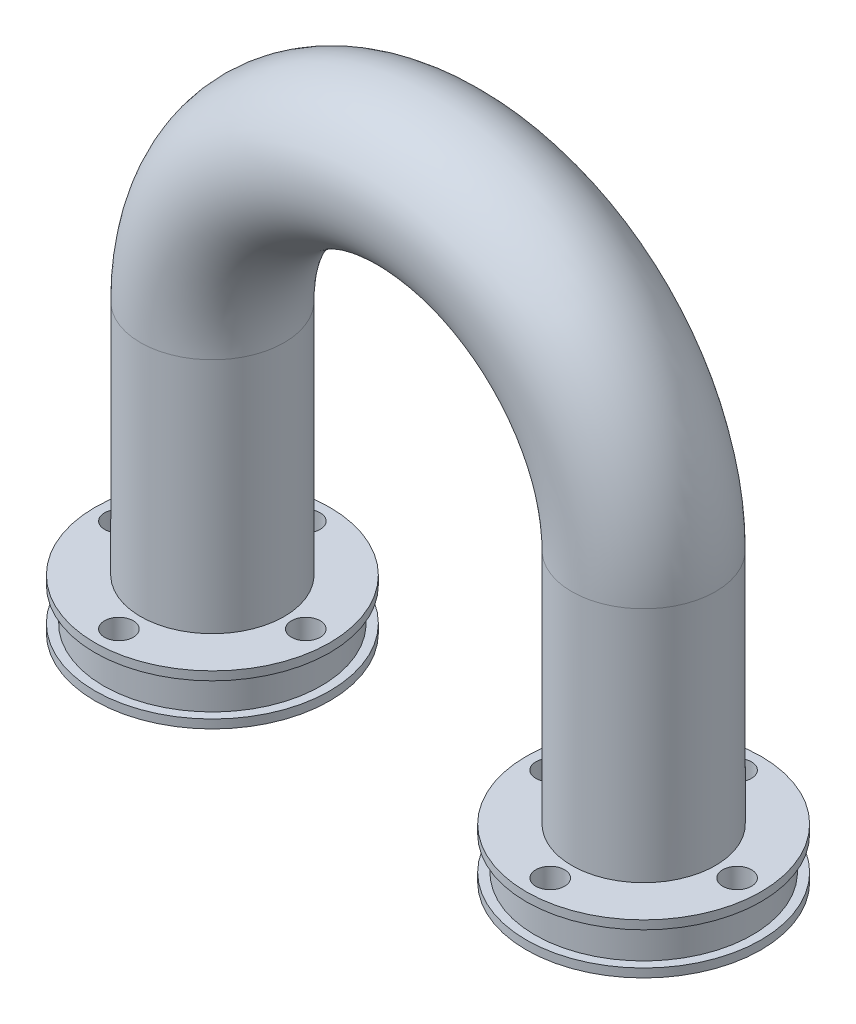
ISO-10303-21;
HEADER;
FILE_DESCRIPTION(('STEP AP214'),'2;1');
FILE_NAME('part.step','',(''),(''),'','','');
FILE_SCHEMA(('AUTOMOTIVE_DESIGN { 1 0 10303 214 1 1 1 1 }'));
ENDSEC;
DATA;
#1=APPLICATION_CONTEXT('core data for automotive mechanical design processes');
#2=APPLICATION_PROTOCOL_DEFINITION('international standard','automotive_design',2000,#1);
#3=PRODUCT_CONTEXT('',#1,'mechanical');
#4=PRODUCT('Part','Part','',(#3));
#5=PRODUCT_RELATED_PRODUCT_CATEGORY('part','',(#4));
#6=PRODUCT_DEFINITION_FORMATION('','',#4);
#7=PRODUCT_DEFINITION_CONTEXT('part definition',#1,'design');
#8=PRODUCT_DEFINITION('design','',#6,#7);
#9=PRODUCT_DEFINITION_SHAPE('','',#8);
#10=(LENGTH_UNIT() NAMED_UNIT(*) SI_UNIT(.MILLI.,.METRE.));
#11=(NAMED_UNIT(*) PLANE_ANGLE_UNIT() SI_UNIT($,.RADIAN.));
#12=(NAMED_UNIT(*) SI_UNIT($,.STERADIAN.) SOLID_ANGLE_UNIT());
#13=UNCERTAINTY_MEASURE_WITH_UNIT(LENGTH_MEASURE(1.E-05),#10,'distance_accuracy_value','');
#14=(GEOMETRIC_REPRESENTATION_CONTEXT(3) GLOBAL_UNCERTAINTY_ASSIGNED_CONTEXT((#13)) GLOBAL_UNIT_ASSIGNED_CONTEXT((#10,
#11,#12)) REPRESENTATION_CONTEXT('',''));
#15=CARTESIAN_POINT('',(0.,0.,0.));
#16=DIRECTION('',(0.,0.,1.));
#17=DIRECTION('',(1.,0.,0.));
#18=AXIS2_PLACEMENT_3D('',#15,#16,#17);
#19=CARTESIAN_POINT('',(30.,-33.,0.));
#20=DIRECTION('',(0.,1.,0.));
#21=DIRECTION('',(-1.,0.,0.));
#22=AXIS2_PLACEMENT_3D('',#19,#20,#21);
#23=CYLINDRICAL_SURFACE('',#22,10.);
#24=CARTESIAN_POINT('',(30.,0.,0.));
#25=DIRECTION('',(0.,1.,0.));
#26=DIRECTION('',(-1.,0.,0.));
#27=AXIS2_PLACEMENT_3D('',#24,#25,#26);
#28=CIRCLE('',#27,10.);
#29=CARTESIAN_POINT('',(40.,0.,0.));
#30=VERTEX_POINT('',#29);
#31=EDGE_CURVE('E52',#30,#30,#28,.T.);
#32=ORIENTED_EDGE('',*,*,#31,.F.);
#33=EDGE_LOOP('',(#32));
#34=FACE_BOUND('',#33,.T.);
#35=CARTESIAN_POINT('',(30.,-33.,0.));
#36=DIRECTION('',(0.,1.,0.));
#37=DIRECTION('',(-1.,0.,0.));
#38=AXIS2_PLACEMENT_3D('',#35,#36,#37);
#39=CIRCLE('',#38,10.);
#40=CARTESIAN_POINT('',(20.,-33.,0.));
#41=VERTEX_POINT('',#40);
#42=EDGE_CURVE('E61',#41,#41,#39,.T.);
#43=ORIENTED_EDGE('',*,*,#42,.T.);
#44=EDGE_LOOP('',(#43));
#45=FACE_BOUND('',#44,.T.);
#46=ADVANCED_FACE('F37',(#34,#45),#23,.T.);
#47=CARTESIAN_POINT('',(0.,0.,0.));
#48=DIRECTION('',(0.,0.,1.));
#49=DIRECTION('',(1.,0.,0.));
#50=AXIS2_PLACEMENT_3D('',#47,#48,#49);
#51=TOROIDAL_SURFACE('',#50,30.,10.);
#52=CARTESIAN_POINT('',(-30.,0.,0.));
#53=DIRECTION('',(0.,-1.,0.));
#54=DIRECTION('',(1.,0.,0.));
#55=AXIS2_PLACEMENT_3D('',#52,#53,#54);
#56=CIRCLE('',#55,10.);
#57=CARTESIAN_POINT('',(-40.,0.,0.));
#58=VERTEX_POINT('',#57);
#59=EDGE_CURVE('E46',#58,#58,#56,.T.);
#60=CARTESIAN_POINT('',(0.,0.,0.));
#61=DIRECTION('',(0.,0.,1.));
#62=DIRECTION('',(1.,0.,0.));
#63=AXIS2_PLACEMENT_3D('',#60,#61,#62);
#64=CIRCLE('',#63,40.);
#65=EDGE_CURVE('',#30,#58,#64,.T.);
#66=ORIENTED_EDGE('',*,*,#31,.T.);
#67=ORIENTED_EDGE('',*,*,#59,.F.);
#68=ORIENTED_EDGE('',*,*,#65,.T.);
#69=ORIENTED_EDGE('',*,*,#65,.F.);
#70=EDGE_LOOP('',(#66,#68,#67,#69));
#71=FACE_BOUND('',#70,.T.);
#72=ADVANCED_FACE('F188',(#71),#51,.T.);
#73=CARTESIAN_POINT('',(-30.,0.,0.));
#74=DIRECTION('',(0.,-1.,0.));
#75=DIRECTION('',(1.,0.,0.));
#76=AXIS2_PLACEMENT_3D('',#73,#74,#75);
#77=CYLINDRICAL_SURFACE('',#76,10.);
#78=CARTESIAN_POINT('',(-30.,-33.,0.));
#79=DIRECTION('',(0.,-1.,0.));
#80=DIRECTION('',(1.,0.,0.));
#81=AXIS2_PLACEMENT_3D('',#78,#79,#80);
#82=CIRCLE('',#81,10.);
#83=CARTESIAN_POINT('',(-20.,-33.,0.));
#84=VERTEX_POINT('',#83);
#85=EDGE_CURVE('E10',#84,#84,#82,.T.);
#86=ORIENTED_EDGE('',*,*,#85,.F.);
#87=EDGE_LOOP('',(#86));
#88=FACE_BOUND('',#87,.T.);
#89=ORIENTED_EDGE('',*,*,#59,.T.);
#90=EDGE_LOOP('',(#89));
#91=FACE_BOUND('',#90,.T.);
#92=ADVANCED_FACE('F39',(#88,#91),#77,.T.);
#93=CARTESIAN_POINT('',(30.,-33.,0.));
#94=DIRECTION('',(0.,1.,0.));
#95=DIRECTION('',(-1.,0.,0.));
#96=AXIS2_PLACEMENT_3D('',#93,#94,#95);
#97=CYLINDRICAL_SURFACE('',#96,6.);
#98=CARTESIAN_POINT('',(30.,0.,0.));
#99=DIRECTION('',(0.,-1.,0.));
#100=DIRECTION('',(1.,0.,0.));
#101=AXIS2_PLACEMENT_3D('',#98,#99,#100);
#102=CIRCLE('',#101,6.);
#103=CARTESIAN_POINT('',(36.,0.,0.));
#104=VERTEX_POINT('',#103);
#105=EDGE_CURVE('E174',#104,#104,#102,.F.);
#106=ORIENTED_EDGE('',*,*,#105,.T.);
#107=EDGE_LOOP('',(#106));
#108=FACE_BOUND('',#107,.T.);
#109=CARTESIAN_POINT('',(30.,-40.,0.));
#110=DIRECTION('',(0.,1.,0.));
#111=DIRECTION('',(0.,0.,-1.));
#112=AXIS2_PLACEMENT_3D('',#109,#110,#111);
#113=CIRCLE('',#112,6.);
#114=CARTESIAN_POINT('',(30.,-40.,-6.));
#115=VERTEX_POINT('',#114);
#116=EDGE_CURVE('E130',#115,#115,#113,.T.);
#117=ORIENTED_EDGE('',*,*,#116,.F.);
#118=EDGE_LOOP('',(#117));
#119=FACE_BOUND('',#118,.T.);
#120=ADVANCED_FACE('F222',(#108,#119),#97,.F.);
#121=CARTESIAN_POINT('',(0.,0.,0.));
#122=DIRECTION('',(0.,0.,1.));
#123=DIRECTION('',(1.,0.,0.));
#124=AXIS2_PLACEMENT_3D('',#121,#122,#123);
#125=TOROIDAL_SURFACE('',#124,30.,6.);
#126=CARTESIAN_POINT('',(-30.,0.,0.));
#127=DIRECTION('',(0.,-1.,0.));
#128=DIRECTION('',(1.,0.,0.));
#129=AXIS2_PLACEMENT_3D('',#126,#127,#128);
#130=CIRCLE('',#129,6.);
#131=CARTESIAN_POINT('',(-36.,0.,0.));
#132=VERTEX_POINT('',#131);
#133=EDGE_CURVE('E178',#132,#132,#130,.T.);
#134=CARTESIAN_POINT('',(0.,0.,0.));
#135=DIRECTION('',(0.,0.,1.));
#136=DIRECTION('',(1.,0.,0.));
#137=AXIS2_PLACEMENT_3D('',#134,#135,#136);
#138=CIRCLE('',#137,36.);
#139=EDGE_CURVE('',#104,#132,#138,.T.);
#140=ORIENTED_EDGE('',*,*,#105,.F.);
#141=ORIENTED_EDGE('',*,*,#133,.T.);
#142=ORIENTED_EDGE('',*,*,#139,.T.);
#143=ORIENTED_EDGE('',*,*,#139,.F.);
#144=EDGE_LOOP('',(#140,#142,#141,#143));
#145=FACE_BOUND('',#144,.T.);
#146=ADVANCED_FACE('F228',(#145),#125,.F.);
#147=CARTESIAN_POINT('',(-30.,0.,0.));
#148=DIRECTION('',(0.,-1.,0.));
#149=DIRECTION('',(1.,0.,0.));
#150=AXIS2_PLACEMENT_3D('',#147,#148,#149);
#151=CYLINDRICAL_SURFACE('',#150,6.);
#152=ORIENTED_EDGE('',*,*,#133,.F.);
#153=EDGE_LOOP('',(#152));
#154=FACE_BOUND('',#153,.T.);
#155=CARTESIAN_POINT('',(-30.,-40.,0.));
#156=DIRECTION('',(0.,-1.,0.));
#157=DIRECTION('',(0.,0.,-1.));
#158=AXIS2_PLACEMENT_3D('',#155,#156,#157);
#159=CIRCLE('',#158,6.);
#160=CARTESIAN_POINT('',(-30.,-40.,-6.));
#161=VERTEX_POINT('',#160);
#162=EDGE_CURVE('E170',#161,#161,#159,.T.);
#163=ORIENTED_EDGE('',*,*,#162,.T.);
#164=EDGE_LOOP('',(#163));
#165=FACE_BOUND('',#164,.T.);
#166=ADVANCED_FACE('F193',(#154,#165),#151,.F.);
#167=CARTESIAN_POINT('',(-46.3305839680992,-33.,0.));
#168=DIRECTION('',(0.,-1.,0.));
#169=DIRECTION('',(0.,0.,-1.));
#170=AXIS2_PLACEMENT_3D('',#167,#168,#169);
#171=PLANE('',#170);
#172=CARTESIAN_POINT('',(-30.,-33.,13.));
#173=DIRECTION('',(0.,-1.,0.));
#174=DIRECTION('',(0.,0.,-1.));
#175=AXIS2_PLACEMENT_3D('',#172,#173,#174);
#176=CIRCLE('',#175,2.);
#177=CARTESIAN_POINT('',(-30.,-33.,11.));
#178=VERTEX_POINT('',#177);
#179=EDGE_CURVE('E76',#178,#178,#176,.T.);
#180=ORIENTED_EDGE('',*,*,#179,.T.);
#181=EDGE_LOOP('',(#180));
#182=FACE_BOUND('',#181,.T.);
#183=CARTESIAN_POINT('',(-17.,-33.,0.));
#184=DIRECTION('',(0.,-1.,0.));
#185=DIRECTION('',(0.,0.,-1.));
#186=AXIS2_PLACEMENT_3D('',#183,#184,#185);
#187=CIRCLE('',#186,2.);
#188=CARTESIAN_POINT('',(-17.,-33.,-2.00000000000006));
#189=VERTEX_POINT('',#188);
#190=EDGE_CURVE('E71',#189,#189,#187,.T.);
#191=ORIENTED_EDGE('',*,*,#190,.T.);
#192=EDGE_LOOP('',(#191));
#193=FACE_BOUND('',#192,.T.);
#194=CARTESIAN_POINT('',(-30.0000000000001,-33.,-13.));
#195=DIRECTION('',(0.,-1.,0.));
#196=DIRECTION('',(0.,0.,-1.));
#197=AXIS2_PLACEMENT_3D('',#194,#195,#196);
#198=CIRCLE('',#197,2.);
#199=CARTESIAN_POINT('',(-30.0000000000001,-33.,-15.));
#200=VERTEX_POINT('',#199);
#201=EDGE_CURVE('E66',#200,#200,#198,.T.);
#202=ORIENTED_EDGE('',*,*,#201,.T.);
#203=EDGE_LOOP('',(#202));
#204=FACE_BOUND('',#203,.T.);
#205=CARTESIAN_POINT('',(-43.,-33.,1.50045560022697E-13));
#206=DIRECTION('',(0.,-1.,0.));
#207=DIRECTION('',(0.,0.,-1.));
#208=AXIS2_PLACEMENT_3D('',#205,#206,#207);
#209=CIRCLE('',#208,2.);
#210=CARTESIAN_POINT('',(-43.,-33.,-1.99999999999985));
#211=VERTEX_POINT('',#210);
#212=EDGE_CURVE('E60',#211,#211,#209,.T.);
#213=ORIENTED_EDGE('',*,*,#212,.T.);
#214=EDGE_LOOP('',(#213));
#215=FACE_BOUND('',#214,.T.);
#216=ORIENTED_EDGE('',*,*,#85,.T.);
#217=EDGE_LOOP('',(#216));
#218=FACE_BOUND('',#217,.T.);
#219=CARTESIAN_POINT('',(-30.,-33.,0.));
#220=DIRECTION('',(0.,-1.,0.));
#221=DIRECTION('',(0.,0.,-1.));
#222=AXIS2_PLACEMENT_3D('',#219,#220,#221);
#223=CIRCLE('',#222,16.3305839680993);
#224=CARTESIAN_POINT('',(-30.,-33.,-16.3305839680993));
#225=VERTEX_POINT('',#224);
#226=EDGE_CURVE('E146',#225,#225,#223,.T.);
#227=ORIENTED_EDGE('',*,*,#226,.F.);
#228=EDGE_LOOP('',(#227));
#229=FACE_BOUND('',#228,.T.);
#230=ADVANCED_FACE('F231',(#182,#193,#204,#215,#218,#229),#171,.F.);
#231=CARTESIAN_POINT('',(-36.,-40.,0.));
#232=DIRECTION('',(0.,1.,0.));
#233=DIRECTION('',(0.,0.,1.));
#234=AXIS2_PLACEMENT_3D('',#231,#232,#233);
#235=PLANE('',#234);
#236=CARTESIAN_POINT('',(-30.,-40.,13.));
#237=DIRECTION('',(0.,1.,0.));
#238=DIRECTION('',(0.,0.,1.));
#239=AXIS2_PLACEMENT_3D('',#236,#237,#238);
#240=CIRCLE('',#239,2.);
#241=CARTESIAN_POINT('',(-30.,-40.,15.));
#242=VERTEX_POINT('',#241);
#243=EDGE_CURVE('E72',#242,#242,#240,.T.);
#244=ORIENTED_EDGE('',*,*,#243,.T.);
#245=EDGE_LOOP('',(#244));
#246=FACE_BOUND('',#245,.T.);
#247=CARTESIAN_POINT('',(-17.,-40.,0.));
#248=DIRECTION('',(0.,1.,0.));
#249=DIRECTION('',(0.,0.,1.));
#250=AXIS2_PLACEMENT_3D('',#247,#248,#249);
#251=CIRCLE('',#250,2.);
#252=CARTESIAN_POINT('',(-17.,-40.,1.99999999999994));
#253=VERTEX_POINT('',#252);
#254=EDGE_CURVE('E67',#253,#253,#251,.T.);
#255=ORIENTED_EDGE('',*,*,#254,.T.);
#256=EDGE_LOOP('',(#255));
#257=FACE_BOUND('',#256,.T.);
#258=CARTESIAN_POINT('',(-30.0000000000001,-40.,-13.));
#259=DIRECTION('',(0.,1.,0.));
#260=DIRECTION('',(0.,0.,1.));
#261=AXIS2_PLACEMENT_3D('',#258,#259,#260);
#262=CIRCLE('',#261,2.);
#263=CARTESIAN_POINT('',(-30.0000000000001,-40.,-11.));
#264=VERTEX_POINT('',#263);
#265=EDGE_CURVE('E62',#264,#264,#262,.T.);
#266=ORIENTED_EDGE('',*,*,#265,.T.);
#267=EDGE_LOOP('',(#266));
#268=FACE_BOUND('',#267,.T.);
#269=CARTESIAN_POINT('',(-43.,-40.,1.50045560022697E-13));
#270=DIRECTION('',(0.,1.,0.));
#271=DIRECTION('',(0.,0.,1.));
#272=AXIS2_PLACEMENT_3D('',#269,#270,#271);
#273=CIRCLE('',#272,2.);
#274=CARTESIAN_POINT('',(-43.,-40.,2.00000000000015));
#275=VERTEX_POINT('',#274);
#276=EDGE_CURVE('E56',#275,#275,#273,.T.);
#277=ORIENTED_EDGE('',*,*,#276,.T.);
#278=EDGE_LOOP('',(#277));
#279=FACE_BOUND('',#278,.T.);
#280=ORIENTED_EDGE('',*,*,#162,.F.);
#281=EDGE_LOOP('',(#280));
#282=FACE_BOUND('',#281,.T.);
#283=CARTESIAN_POINT('',(-30.,-40.,0.));
#284=DIRECTION('',(0.,-1.,0.));
#285=DIRECTION('',(0.,0.,-1.));
#286=AXIS2_PLACEMENT_3D('',#283,#284,#285);
#287=CIRCLE('',#286,16.3305839680993);
#288=CARTESIAN_POINT('',(-30.,-40.,-16.3305839680993));
#289=VERTEX_POINT('',#288);
#290=EDGE_CURVE('E166',#289,#289,#287,.T.);
#291=ORIENTED_EDGE('',*,*,#290,.T.);
#292=EDGE_LOOP('',(#291));
#293=FACE_BOUND('',#292,.T.);
#294=ADVANCED_FACE('F246',(#246,#257,#268,#279,#282,#293),#235,.F.);
#295=CARTESIAN_POINT('',(-30.,-33.,0.));
#296=DIRECTION('',(0.,-1.,0.));
#297=DIRECTION('',(0.,0.,-1.));
#298=AXIS2_PLACEMENT_3D('',#295,#296,#297);
#299=CYLINDRICAL_SURFACE('',#298,16.3305839680993);
#300=ORIENTED_EDGE('',*,*,#290,.F.);
#301=EDGE_LOOP('',(#300));
#302=FACE_BOUND('',#301,.T.);
#303=CARTESIAN_POINT('',(-30.,-38.8,0.));
#304=DIRECTION('',(0.,-1.,0.));
#305=DIRECTION('',(0.,0.,-1.));
#306=AXIS2_PLACEMENT_3D('',#303,#304,#305);
#307=CIRCLE('',#306,16.3305839680993);
#308=CARTESIAN_POINT('',(-30.,-38.8,-16.3305839680993));
#309=VERTEX_POINT('',#308);
#310=EDGE_CURVE('E162',#309,#309,#307,.T.);
#311=ORIENTED_EDGE('',*,*,#310,.T.);
#312=EDGE_LOOP('',(#311));
#313=FACE_BOUND('',#312,.T.);
#314=ADVANCED_FACE('F250',(#302,#313),#299,.T.);
#315=CARTESIAN_POINT('',(-46.3305839680992,-38.8,0.));
#316=DIRECTION('',(0.,-1.,0.));
#317=DIRECTION('',(0.,0.,-1.));
#318=AXIS2_PLACEMENT_3D('',#315,#316,#317);
#319=PLANE('',#318);
#320=ORIENTED_EDGE('',*,*,#310,.F.);
#321=EDGE_LOOP('',(#320));
#322=FACE_BOUND('',#321,.T.);
#323=CARTESIAN_POINT('',(-30.,-38.8,0.));
#324=DIRECTION('',(0.,-1.,0.));
#325=DIRECTION('',(0.,0.,-1.));
#326=AXIS2_PLACEMENT_3D('',#323,#324,#325);
#327=CIRCLE('',#326,15.1305839680993);
#328=CARTESIAN_POINT('',(-30.,-38.8,-15.1305839680993));
#329=VERTEX_POINT('',#328);
#330=EDGE_CURVE('E158',#329,#329,#327,.T.);
#331=ORIENTED_EDGE('',*,*,#330,.T.);
#332=EDGE_LOOP('',(#331));
#333=FACE_BOUND('',#332,.T.);
#334=ADVANCED_FACE('F254',(#322,#333),#319,.F.);
#335=CARTESIAN_POINT('',(-30.,-33.,0.));
#336=DIRECTION('',(0.,-1.,0.));
#337=DIRECTION('',(0.,0.,-1.));
#338=AXIS2_PLACEMENT_3D('',#335,#336,#337);
#339=CYLINDRICAL_SURFACE('',#338,15.1305839680993);
#340=ORIENTED_EDGE('',*,*,#330,.F.);
#341=EDGE_LOOP('',(#340));
#342=FACE_BOUND('',#341,.T.);
#343=CARTESIAN_POINT('',(-30.,-34.2,0.));
#344=DIRECTION('',(0.,-1.,0.));
#345=DIRECTION('',(0.,0.,-1.));
#346=AXIS2_PLACEMENT_3D('',#343,#344,#345);
#347=CIRCLE('',#346,15.1305839680993);
#348=CARTESIAN_POINT('',(-30.,-34.2,-15.1305839680993));
#349=VERTEX_POINT('',#348);
#350=EDGE_CURVE('E154',#349,#349,#347,.T.);
#351=ORIENTED_EDGE('',*,*,#350,.T.);
#352=EDGE_LOOP('',(#351));
#353=FACE_BOUND('',#352,.T.);
#354=ADVANCED_FACE('F258',(#342,#353),#339,.T.);
#355=CARTESIAN_POINT('',(-45.1305839680993,-34.2,0.));
#356=DIRECTION('',(0.,1.,0.));
#357=DIRECTION('',(0.,0.,1.));
#358=AXIS2_PLACEMENT_3D('',#355,#356,#357);
#359=PLANE('',#358);
#360=ORIENTED_EDGE('',*,*,#350,.F.);
#361=EDGE_LOOP('',(#360));
#362=FACE_BOUND('',#361,.T.);
#363=CARTESIAN_POINT('',(-30.,-34.2,0.));
#364=DIRECTION('',(0.,-1.,0.));
#365=DIRECTION('',(0.,0.,-1.));
#366=AXIS2_PLACEMENT_3D('',#363,#364,#365);
#367=CIRCLE('',#366,16.3305839680993);
#368=CARTESIAN_POINT('',(-30.,-34.2,-16.3305839680993));
#369=VERTEX_POINT('',#368);
#370=EDGE_CURVE('E150',#369,#369,#367,.T.);
#371=ORIENTED_EDGE('',*,*,#370,.T.);
#372=EDGE_LOOP('',(#371));
#373=FACE_BOUND('',#372,.T.);
#374=ADVANCED_FACE('F262',(#362,#373),#359,.F.);
#375=CARTESIAN_POINT('',(-30.,-33.,0.));
#376=DIRECTION('',(0.,-1.,0.));
#377=DIRECTION('',(0.,0.,-1.));
#378=AXIS2_PLACEMENT_3D('',#375,#376,#377);
#379=CYLINDRICAL_SURFACE('',#378,16.3305839680993);
#380=ORIENTED_EDGE('',*,*,#370,.F.);
#381=EDGE_LOOP('',(#380));
#382=FACE_BOUND('',#381,.T.);
#383=ORIENTED_EDGE('',*,*,#226,.T.);
#384=EDGE_LOOP('',(#383));
#385=FACE_BOUND('',#384,.T.);
#386=ADVANCED_FACE('F266',(#382,#385),#379,.T.);
#387=CARTESIAN_POINT('',(-43.,-23.,1.50045560022697E-13));
#388=DIRECTION('',(0.,-1.,0.));
#389=DIRECTION('',(1.,0.,0.));
#390=AXIS2_PLACEMENT_3D('',#387,#388,#389);
#391=CYLINDRICAL_SURFACE('',#390,2.);
#392=ORIENTED_EDGE('',*,*,#276,.F.);
#393=EDGE_LOOP('',(#392));
#394=FACE_BOUND('',#393,.T.);
#395=ORIENTED_EDGE('',*,*,#212,.F.);
#396=EDGE_LOOP('',(#395));
#397=FACE_BOUND('',#396,.T.);
#398=ADVANCED_FACE('F270',(#394,#397),#391,.F.);
#399=CARTESIAN_POINT('',(-30.0000000000001,-23.,-13.));
#400=DIRECTION('',(0.,-1.,0.));
#401=DIRECTION('',(1.,0.,0.));
#402=AXIS2_PLACEMENT_3D('',#399,#400,#401);
#403=CYLINDRICAL_SURFACE('',#402,2.);
#404=ORIENTED_EDGE('',*,*,#265,.F.);
#405=EDGE_LOOP('',(#404));
#406=FACE_BOUND('',#405,.T.);
#407=ORIENTED_EDGE('',*,*,#201,.F.);
#408=EDGE_LOOP('',(#407));
#409=FACE_BOUND('',#408,.T.);
#410=ADVANCED_FACE('F274',(#406,#409),#403,.F.);
#411=CARTESIAN_POINT('',(-17.,-23.,0.));
#412=DIRECTION('',(0.,-1.,0.));
#413=DIRECTION('',(1.,0.,0.));
#414=AXIS2_PLACEMENT_3D('',#411,#412,#413);
#415=CYLINDRICAL_SURFACE('',#414,2.);
#416=ORIENTED_EDGE('',*,*,#254,.F.);
#417=EDGE_LOOP('',(#416));
#418=FACE_BOUND('',#417,.T.);
#419=ORIENTED_EDGE('',*,*,#190,.F.);
#420=EDGE_LOOP('',(#419));
#421=FACE_BOUND('',#420,.T.);
#422=ADVANCED_FACE('F278',(#418,#421),#415,.F.);
#423=CARTESIAN_POINT('',(-30.,-23.,13.));
#424=DIRECTION('',(0.,-1.,0.));
#425=DIRECTION('',(1.,0.,0.));
#426=AXIS2_PLACEMENT_3D('',#423,#424,#425);
#427=CYLINDRICAL_SURFACE('',#426,2.);
#428=ORIENTED_EDGE('',*,*,#243,.F.);
#429=EDGE_LOOP('',(#428));
#430=FACE_BOUND('',#429,.T.);
#431=ORIENTED_EDGE('',*,*,#179,.F.);
#432=EDGE_LOOP('',(#431));
#433=FACE_BOUND('',#432,.T.);
#434=ADVANCED_FACE('F200',(#430,#433),#427,.F.);
#435=CARTESIAN_POINT('',(46.3305839680992,-33.,0.));
#436=DIRECTION('',(0.,-1.,0.));
#437=DIRECTION('',(0.,0.,-1.));
#438=AXIS2_PLACEMENT_3D('',#435,#436,#437);
#439=PLANE('',#438);
#440=CARTESIAN_POINT('',(30.,-33.,13.));
#441=DIRECTION('',(0.,-1.,0.));
#442=DIRECTION('',(0.,0.,-1.));
#443=AXIS2_PLACEMENT_3D('',#440,#441,#442);
#444=CIRCLE('',#443,2.);
#445=CARTESIAN_POINT('',(30.,-33.,11.));
#446=VERTEX_POINT('',#445);
#447=EDGE_CURVE('E102',#446,#446,#444,.F.);
#448=ORIENTED_EDGE('',*,*,#447,.F.);
#449=EDGE_LOOP('',(#448));
#450=FACE_BOUND('',#449,.T.);
#451=CARTESIAN_POINT('',(17.,-33.,0.));
#452=DIRECTION('',(0.,-1.,0.));
#453=DIRECTION('',(0.,0.,-1.));
#454=AXIS2_PLACEMENT_3D('',#451,#452,#453);
#455=CIRCLE('',#454,2.);
#456=CARTESIAN_POINT('',(17.,-33.,-2.00000000000006));
#457=VERTEX_POINT('',#456);
#458=EDGE_CURVE('E89',#457,#457,#455,.F.);
#459=ORIENTED_EDGE('',*,*,#458,.F.);
#460=EDGE_LOOP('',(#459));
#461=FACE_BOUND('',#460,.T.);
#462=CARTESIAN_POINT('',(30.0000000000001,-33.,-13.));
#463=DIRECTION('',(0.,-1.,0.));
#464=DIRECTION('',(0.,0.,-1.));
#465=AXIS2_PLACEMENT_3D('',#462,#463,#464);
#466=CIRCLE('',#465,2.);
#467=CARTESIAN_POINT('',(30.0000000000001,-33.,-15.));
#468=VERTEX_POINT('',#467);
#469=EDGE_CURVE('E85',#468,#468,#466,.F.);
#470=ORIENTED_EDGE('',*,*,#469,.F.);
#471=EDGE_LOOP('',(#470));
#472=FACE_BOUND('',#471,.T.);
#473=CARTESIAN_POINT('',(43.,-33.,1.50045560022697E-13));
#474=DIRECTION('',(0.,-1.,0.));
#475=DIRECTION('',(0.,0.,-1.));
#476=AXIS2_PLACEMENT_3D('',#473,#474,#475);
#477=CIRCLE('',#476,2.);
#478=CARTESIAN_POINT('',(43.,-33.,-1.99999999999985));
#479=VERTEX_POINT('',#478);
#480=EDGE_CURVE('E81',#479,#479,#477,.F.);
#481=ORIENTED_EDGE('',*,*,#480,.F.);
#482=EDGE_LOOP('',(#481));
#483=FACE_BOUND('',#482,.T.);
#484=ORIENTED_EDGE('',*,*,#42,.F.);
#485=EDGE_LOOP('',(#484));
#486=FACE_BOUND('',#485,.T.);
#487=CARTESIAN_POINT('',(30.,-33.,0.));
#488=DIRECTION('',(0.,1.,0.));
#489=DIRECTION('',(0.,0.,-1.));
#490=AXIS2_PLACEMENT_3D('',#487,#488,#489);
#491=CIRCLE('',#490,16.3305839680993);
#492=CARTESIAN_POINT('',(30.,-33.,-16.3305839680993));
#493=VERTEX_POINT('',#492);
#494=EDGE_CURVE('E106',#493,#493,#491,.T.);
#495=ORIENTED_EDGE('',*,*,#494,.T.);
#496=EDGE_LOOP('',(#495));
#497=FACE_BOUND('',#496,.T.);
#498=ADVANCED_FACE('F196',(#450,#461,#472,#483,#486,#497),#439,.F.);
#499=CARTESIAN_POINT('',(36.,-40.,0.));
#500=DIRECTION('',(0.,1.,0.));
#501=DIRECTION('',(0.,0.,1.));
#502=AXIS2_PLACEMENT_3D('',#499,#500,#501);
#503=PLANE('',#502);
#504=CARTESIAN_POINT('',(30.,-40.,13.));
#505=DIRECTION('',(0.,1.,0.));
#506=DIRECTION('',(0.,0.,1.));
#507=AXIS2_PLACEMENT_3D('',#504,#505,#506);
#508=CIRCLE('',#507,2.);
#509=CARTESIAN_POINT('',(30.,-40.,15.));
#510=VERTEX_POINT('',#509);
#511=EDGE_CURVE('E41',#510,#510,#508,.F.);
#512=ORIENTED_EDGE('',*,*,#511,.F.);
#513=EDGE_LOOP('',(#512));
#514=FACE_BOUND('',#513,.T.);
#515=CARTESIAN_POINT('',(17.,-40.,0.));
#516=DIRECTION('',(0.,1.,0.));
#517=DIRECTION('',(0.,0.,1.));
#518=AXIS2_PLACEMENT_3D('',#515,#516,#517);
#519=CIRCLE('',#518,2.);
#520=CARTESIAN_POINT('',(17.,-40.,1.99999999999994));
#521=VERTEX_POINT('',#520);
#522=EDGE_CURVE('E86',#521,#521,#519,.F.);
#523=ORIENTED_EDGE('',*,*,#522,.F.);
#524=EDGE_LOOP('',(#523));
#525=FACE_BOUND('',#524,.T.);
#526=CARTESIAN_POINT('',(30.0000000000001,-40.,-13.));
#527=DIRECTION('',(0.,1.,0.));
#528=DIRECTION('',(0.,0.,1.));
#529=AXIS2_PLACEMENT_3D('',#526,#527,#528);
#530=CIRCLE('',#529,2.);
#531=CARTESIAN_POINT('',(30.0000000000001,-40.,-11.));
#532=VERTEX_POINT('',#531);
#533=EDGE_CURVE('E82',#532,#532,#530,.F.);
#534=ORIENTED_EDGE('',*,*,#533,.F.);
#535=EDGE_LOOP('',(#534));
#536=FACE_BOUND('',#535,.T.);
#537=CARTESIAN_POINT('',(43.,-40.,1.50045560022697E-13));
#538=DIRECTION('',(0.,1.,0.));
#539=DIRECTION('',(0.,0.,1.));
#540=AXIS2_PLACEMENT_3D('',#537,#538,#539);
#541=CIRCLE('',#540,2.);
#542=CARTESIAN_POINT('',(43.,-40.,2.00000000000015));
#543=VERTEX_POINT('',#542);
#544=EDGE_CURVE('E77',#543,#543,#541,.F.);
#545=ORIENTED_EDGE('',*,*,#544,.F.);
#546=EDGE_LOOP('',(#545));
#547=FACE_BOUND('',#546,.T.);
#548=ORIENTED_EDGE('',*,*,#116,.T.);
#549=EDGE_LOOP('',(#548));
#550=FACE_BOUND('',#549,.T.);
#551=CARTESIAN_POINT('',(30.,-40.,0.));
#552=DIRECTION('',(0.,1.,0.));
#553=DIRECTION('',(0.,0.,-1.));
#554=AXIS2_PLACEMENT_3D('',#551,#552,#553);
#555=CIRCLE('',#554,16.3305839680993);
#556=CARTESIAN_POINT('',(30.,-40.,-16.3305839680993));
#557=VERTEX_POINT('',#556);
#558=EDGE_CURVE('E126',#557,#557,#555,.T.);
#559=ORIENTED_EDGE('',*,*,#558,.F.);
#560=EDGE_LOOP('',(#559));
#561=FACE_BOUND('',#560,.T.);
#562=ADVANCED_FACE('F199',(#514,#525,#536,#547,#550,#561),#503,.F.);
#563=CARTESIAN_POINT('',(30.,-33.,0.));
#564=DIRECTION('',(0.,-1.,0.));
#565=DIRECTION('',(0.,0.,-1.));
#566=AXIS2_PLACEMENT_3D('',#563,#564,#565);
#567=CYLINDRICAL_SURFACE('',#566,16.3305839680993);
#568=ORIENTED_EDGE('',*,*,#558,.T.);
#569=EDGE_LOOP('',(#568));
#570=FACE_BOUND('',#569,.T.);
#571=CARTESIAN_POINT('',(30.,-38.8,0.));
#572=DIRECTION('',(0.,1.,0.));
#573=DIRECTION('',(0.,0.,-1.));
#574=AXIS2_PLACEMENT_3D('',#571,#572,#573);
#575=CIRCLE('',#574,16.3305839680993);
#576=CARTESIAN_POINT('',(30.,-38.8,-16.3305839680993));
#577=VERTEX_POINT('',#576);
#578=EDGE_CURVE('E122',#577,#577,#575,.T.);
#579=ORIENTED_EDGE('',*,*,#578,.F.);
#580=EDGE_LOOP('',(#579));
#581=FACE_BOUND('',#580,.T.);
#582=ADVANCED_FACE('F288',(#570,#581),#567,.T.);
#583=CARTESIAN_POINT('',(46.3305839680992,-38.8,0.));
#584=DIRECTION('',(0.,-1.,0.));
#585=DIRECTION('',(0.,0.,-1.));
#586=AXIS2_PLACEMENT_3D('',#583,#584,#585);
#587=PLANE('',#586);
#588=ORIENTED_EDGE('',*,*,#578,.T.);
#589=EDGE_LOOP('',(#588));
#590=FACE_BOUND('',#589,.T.);
#591=CARTESIAN_POINT('',(30.,-38.8,0.));
#592=DIRECTION('',(0.,1.,0.));
#593=DIRECTION('',(0.,0.,-1.));
#594=AXIS2_PLACEMENT_3D('',#591,#592,#593);
#595=CIRCLE('',#594,15.1305839680993);
#596=CARTESIAN_POINT('',(30.,-38.8,-15.1305839680993));
#597=VERTEX_POINT('',#596);
#598=EDGE_CURVE('E118',#597,#597,#595,.T.);
#599=ORIENTED_EDGE('',*,*,#598,.F.);
#600=EDGE_LOOP('',(#599));
#601=FACE_BOUND('',#600,.T.);
#602=ADVANCED_FACE('F292',(#590,#601),#587,.F.);
#603=CARTESIAN_POINT('',(30.,-33.,0.));
#604=DIRECTION('',(0.,-1.,0.));
#605=DIRECTION('',(0.,0.,-1.));
#606=AXIS2_PLACEMENT_3D('',#603,#604,#605);
#607=CYLINDRICAL_SURFACE('',#606,15.1305839680993);
#608=ORIENTED_EDGE('',*,*,#598,.T.);
#609=EDGE_LOOP('',(#608));
#610=FACE_BOUND('',#609,.T.);
#611=CARTESIAN_POINT('',(30.,-34.2,0.));
#612=DIRECTION('',(0.,1.,0.));
#613=DIRECTION('',(0.,0.,-1.));
#614=AXIS2_PLACEMENT_3D('',#611,#612,#613);
#615=CIRCLE('',#614,15.1305839680993);
#616=CARTESIAN_POINT('',(30.,-34.2,-15.1305839680993));
#617=VERTEX_POINT('',#616);
#618=EDGE_CURVE('E114',#617,#617,#615,.T.);
#619=ORIENTED_EDGE('',*,*,#618,.F.);
#620=EDGE_LOOP('',(#619));
#621=FACE_BOUND('',#620,.T.);
#622=ADVANCED_FACE('F218',(#610,#621),#607,.T.);
#623=CARTESIAN_POINT('',(45.1305839680993,-34.2,0.));
#624=DIRECTION('',(0.,1.,0.));
#625=DIRECTION('',(0.,0.,1.));
#626=AXIS2_PLACEMENT_3D('',#623,#624,#625);
#627=PLANE('',#626);
#628=ORIENTED_EDGE('',*,*,#618,.T.);
#629=EDGE_LOOP('',(#628));
#630=FACE_BOUND('',#629,.T.);
#631=CARTESIAN_POINT('',(30.,-34.2,0.));
#632=DIRECTION('',(0.,1.,0.));
#633=DIRECTION('',(0.,0.,-1.));
#634=AXIS2_PLACEMENT_3D('',#631,#632,#633);
#635=CIRCLE('',#634,16.3305839680993);
#636=CARTESIAN_POINT('',(30.,-34.2,-16.3305839680993));
#637=VERTEX_POINT('',#636);
#638=EDGE_CURVE('E110',#637,#637,#635,.T.);
#639=ORIENTED_EDGE('',*,*,#638,.F.);
#640=EDGE_LOOP('',(#639));
#641=FACE_BOUND('',#640,.T.);
#642=ADVANCED_FACE('F208',(#630,#641),#627,.F.);
#643=CARTESIAN_POINT('',(30.,-33.,0.));
#644=DIRECTION('',(0.,-1.,0.));
#645=DIRECTION('',(0.,0.,-1.));
#646=AXIS2_PLACEMENT_3D('',#643,#644,#645);
#647=CYLINDRICAL_SURFACE('',#646,16.3305839680993);
#648=ORIENTED_EDGE('',*,*,#638,.T.);
#649=EDGE_LOOP('',(#648));
#650=FACE_BOUND('',#649,.T.);
#651=ORIENTED_EDGE('',*,*,#494,.F.);
#652=EDGE_LOOP('',(#651));
#653=FACE_BOUND('',#652,.T.);
#654=ADVANCED_FACE('F205',(#650,#653),#647,.T.);
#655=CARTESIAN_POINT('',(43.,-23.,1.50045560022697E-13));
#656=DIRECTION('',(0.,-1.,0.));
#657=DIRECTION('',(1.,0.,0.));
#658=AXIS2_PLACEMENT_3D('',#655,#656,#657);
#659=CYLINDRICAL_SURFACE('',#658,2.);
#660=ORIENTED_EDGE('',*,*,#544,.T.);
#661=EDGE_LOOP('',(#660));
#662=FACE_BOUND('',#661,.T.);
#663=ORIENTED_EDGE('',*,*,#480,.T.);
#664=EDGE_LOOP('',(#663));
#665=FACE_BOUND('',#664,.T.);
#666=ADVANCED_FACE('F207',(#662,#665),#659,.F.);
#667=CARTESIAN_POINT('',(30.0000000000001,-23.,-13.));
#668=DIRECTION('',(0.,-1.,0.));
#669=DIRECTION('',(1.,0.,0.));
#670=AXIS2_PLACEMENT_3D('',#667,#668,#669);
#671=CYLINDRICAL_SURFACE('',#670,2.);
#672=ORIENTED_EDGE('',*,*,#533,.T.);
#673=EDGE_LOOP('',(#672));
#674=FACE_BOUND('',#673,.T.);
#675=ORIENTED_EDGE('',*,*,#469,.T.);
#676=EDGE_LOOP('',(#675));
#677=FACE_BOUND('',#676,.T.);
#678=ADVANCED_FACE('F215',(#674,#677),#671,.F.);
#679=CARTESIAN_POINT('',(17.,-23.,0.));
#680=DIRECTION('',(0.,-1.,0.));
#681=DIRECTION('',(1.,0.,0.));
#682=AXIS2_PLACEMENT_3D('',#679,#680,#681);
#683=CYLINDRICAL_SURFACE('',#682,2.);
#684=ORIENTED_EDGE('',*,*,#522,.T.);
#685=EDGE_LOOP('',(#684));
#686=FACE_BOUND('',#685,.T.);
#687=ORIENTED_EDGE('',*,*,#458,.T.);
#688=EDGE_LOOP('',(#687));
#689=FACE_BOUND('',#688,.T.);
#690=ADVANCED_FACE('F332',(#686,#689),#683,.F.);
#691=CARTESIAN_POINT('',(30.,-23.,13.));
#692=DIRECTION('',(0.,-1.,0.));
#693=DIRECTION('',(1.,0.,0.));
#694=AXIS2_PLACEMENT_3D('',#691,#692,#693);
#695=CYLINDRICAL_SURFACE('',#694,2.);
#696=ORIENTED_EDGE('',*,*,#511,.T.);
#697=EDGE_LOOP('',(#696));
#698=FACE_BOUND('',#697,.T.);
#699=ORIENTED_EDGE('',*,*,#447,.T.);
#700=EDGE_LOOP('',(#699));
#701=FACE_BOUND('',#700,.T.);
#702=ADVANCED_FACE('F342',(#698,#701),#695,.F.);
#703=CLOSED_SHELL('',(#46,#72,#92,#120,#146,#166,#230,#294,#314,#334,#354,#374,#386,#398,#410,
#422,#434,#498,#562,#582,#602,#622,#642,#654,#666,#678,#690,#702));
#704=MANIFOLD_SOLID_BREP('B2',#703);
#705=ADVANCED_BREP_SHAPE_REPRESENTATION('',(#18,#704),#14);
#706=SHAPE_DEFINITION_REPRESENTATION(#9,#705);
ENDSEC;
END-ISO-10303-21;
